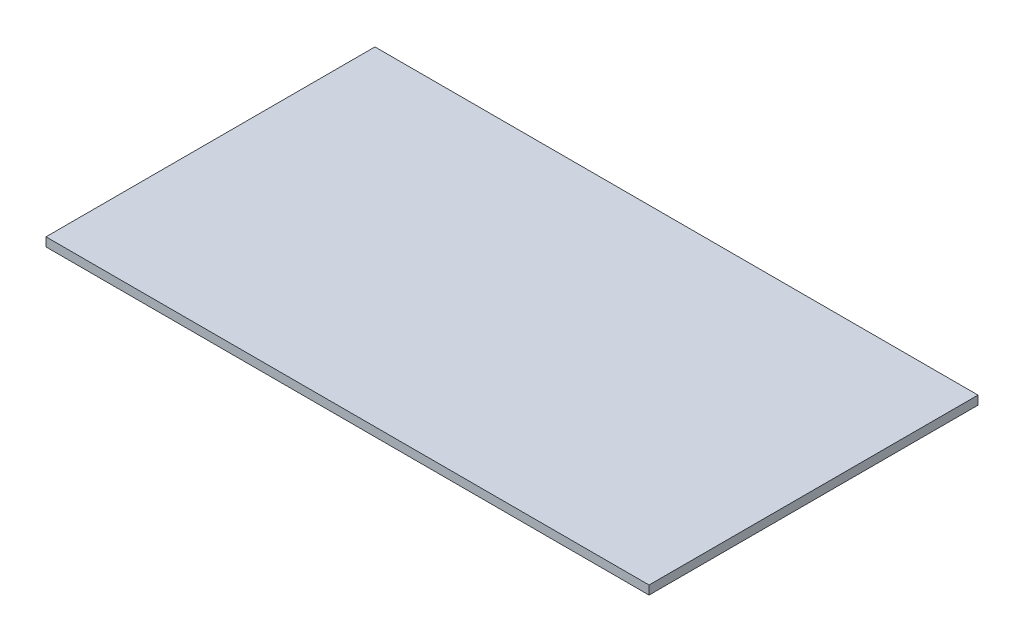
ISO-10303-21;
HEADER;
FILE_DESCRIPTION(('STEP AP214'),'2;1');
FILE_NAME('part.step','',(''),(''),'','','');
FILE_SCHEMA(('AUTOMOTIVE_DESIGN { 1 0 10303 214 1 1 1 1 }'));
ENDSEC;
DATA;
#1=APPLICATION_CONTEXT('core data for automotive mechanical design processes');
#2=APPLICATION_PROTOCOL_DEFINITION('international standard','automotive_design',2000,#1);
#3=PRODUCT_CONTEXT('',#1,'mechanical');
#4=PRODUCT('Part','Part','',(#3));
#5=PRODUCT_RELATED_PRODUCT_CATEGORY('part','',(#4));
#6=PRODUCT_DEFINITION_FORMATION('','',#4);
#7=PRODUCT_DEFINITION_CONTEXT('part definition',#1,'design');
#8=PRODUCT_DEFINITION('design','',#6,#7);
#9=PRODUCT_DEFINITION_SHAPE('','',#8);
#10=(LENGTH_UNIT() NAMED_UNIT(*) SI_UNIT(.MILLI.,.METRE.));
#11=(NAMED_UNIT(*) PLANE_ANGLE_UNIT() SI_UNIT($,.RADIAN.));
#12=(NAMED_UNIT(*) SI_UNIT($,.STERADIAN.) SOLID_ANGLE_UNIT());
#13=UNCERTAINTY_MEASURE_WITH_UNIT(LENGTH_MEASURE(1.E-05),#10,'distance_accuracy_value','');
#14=(GEOMETRIC_REPRESENTATION_CONTEXT(3) GLOBAL_UNCERTAINTY_ASSIGNED_CONTEXT((#13)) GLOBAL_UNIT_ASSIGNED_CONTEXT((#10,
#11,#12)) REPRESENTATION_CONTEXT('',''));
#15=CARTESIAN_POINT('',(0.,0.,0.));
#16=DIRECTION('',(0.,0.,1.));
#17=DIRECTION('',(1.,0.,0.));
#18=AXIS2_PLACEMENT_3D('',#15,#16,#17);
#19=CARTESIAN_POINT('',(275.,8.,150.));
#20=DIRECTION('',(-1.,0.,0.));
#21=DIRECTION('',(0.,0.,1.));
#22=AXIS2_PLACEMENT_3D('',#19,#20,#21);
#23=PLANE('',#22);
#24=DIRECTION('',(0.,0.,-1.));
#25=VECTOR('',#24,1.);
#26=CARTESIAN_POINT('',(275.,0.,150.));
#27=LINE('',#26,#25);
#28=CARTESIAN_POINT('',(275.,0.,150.));
#29=VERTEX_POINT('',#28);
#30=CARTESIAN_POINT('',(275.,0.,-150.));
#31=VERTEX_POINT('',#30);
#32=EDGE_CURVE('E96',#29,#31,#27,.T.);
#33=ORIENTED_EDGE('',*,*,#32,.T.);
#34=DIRECTION('',(0.,-1.,0.));
#35=VECTOR('',#34,1.);
#36=CARTESIAN_POINT('',(275.,8.,-150.));
#37=LINE('',#36,#35);
#38=CARTESIAN_POINT('',(275.,8.,-150.));
#39=VERTEX_POINT('',#38);
#40=EDGE_CURVE('E11',#39,#31,#37,.T.);
#41=ORIENTED_EDGE('',*,*,#40,.F.);
#42=DIRECTION('',(0.,0.,-1.));
#43=VECTOR('',#42,1.);
#44=CARTESIAN_POINT('',(275.,8.,150.));
#45=LINE('',#44,#43);
#46=CARTESIAN_POINT('',(275.,8.,150.));
#47=VERTEX_POINT('',#46);
#48=EDGE_CURVE('E84',#47,#39,#45,.T.);
#49=ORIENTED_EDGE('',*,*,#48,.F.);
#50=DIRECTION('',(0.,-1.,0.));
#51=VECTOR('',#50,1.);
#52=CARTESIAN_POINT('',(275.,8.,150.));
#53=LINE('',#52,#51);
#54=EDGE_CURVE('E92',#47,#29,#53,.T.);
#55=ORIENTED_EDGE('',*,*,#54,.T.);
#56=EDGE_LOOP('',(#33,#41,#49,#55));
#57=FACE_BOUND('',#56,.T.);
#58=ADVANCED_FACE('F33',(#57),#23,.F.);
#59=CARTESIAN_POINT('',(-275.,8.,-150.));
#60=DIRECTION('',(0.,0.,1.));
#61=DIRECTION('',(1.,0.,0.));
#62=AXIS2_PLACEMENT_3D('',#59,#60,#61);
#63=PLANE('',#62);
#64=DIRECTION('',(-1.,0.,0.));
#65=VECTOR('',#64,1.);
#66=CARTESIAN_POINT('',(-275.,0.,-150.));
#67=LINE('',#66,#65);
#68=CARTESIAN_POINT('',(-275.,0.,-150.));
#69=VERTEX_POINT('',#68);
#70=EDGE_CURVE('E88',#31,#69,#67,.T.);
#71=ORIENTED_EDGE('',*,*,#70,.T.);
#72=DIRECTION('',(0.,-1.,0.));
#73=VECTOR('',#72,1.);
#74=CARTESIAN_POINT('',(-275.,8.,-150.));
#75=LINE('',#74,#73);
#76=CARTESIAN_POINT('',(-275.,8.,-150.));
#77=VERTEX_POINT('',#76);
#78=EDGE_CURVE('E41',#77,#69,#75,.T.);
#79=ORIENTED_EDGE('',*,*,#78,.F.);
#80=DIRECTION('',(-1.,0.,0.));
#81=VECTOR('',#80,1.);
#82=CARTESIAN_POINT('',(-275.,8.,-150.));
#83=LINE('',#82,#81);
#84=EDGE_CURVE('E79',#39,#77,#83,.T.);
#85=ORIENTED_EDGE('',*,*,#84,.F.);
#86=ORIENTED_EDGE('',*,*,#40,.T.);
#87=EDGE_LOOP('',(#71,#79,#85,#86));
#88=FACE_BOUND('',#87,.T.);
#89=ADVANCED_FACE('F87',(#88),#63,.F.);
#90=CARTESIAN_POINT('',(-275.,8.,150.));
#91=DIRECTION('',(1.,0.,0.));
#92=DIRECTION('',(0.,0.,-1.));
#93=AXIS2_PLACEMENT_3D('',#90,#91,#92);
#94=PLANE('',#93);
#95=DIRECTION('',(0.,0.,1.));
#96=VECTOR('',#95,1.);
#97=CARTESIAN_POINT('',(-275.,0.,150.));
#98=LINE('',#97,#96);
#99=CARTESIAN_POINT('',(-275.,0.,150.));
#100=VERTEX_POINT('',#99);
#101=EDGE_CURVE('E66',#69,#100,#98,.T.);
#102=ORIENTED_EDGE('',*,*,#101,.T.);
#103=DIRECTION('',(0.,-1.,0.));
#104=VECTOR('',#103,1.);
#105=CARTESIAN_POINT('',(-275.,8.,150.));
#106=LINE('',#105,#104);
#107=CARTESIAN_POINT('',(-275.,8.,150.));
#108=VERTEX_POINT('',#107);
#109=EDGE_CURVE('E89',#108,#100,#106,.T.);
#110=ORIENTED_EDGE('',*,*,#109,.F.);
#111=DIRECTION('',(0.,0.,1.));
#112=VECTOR('',#111,1.);
#113=CARTESIAN_POINT('',(-275.,8.,150.));
#114=LINE('',#113,#112);
#115=EDGE_CURVE('E82',#77,#108,#114,.T.);
#116=ORIENTED_EDGE('',*,*,#115,.F.);
#117=ORIENTED_EDGE('',*,*,#78,.T.);
#118=EDGE_LOOP('',(#102,#110,#116,#117));
#119=FACE_BOUND('',#118,.T.);
#120=ADVANCED_FACE('F90',(#119),#94,.F.);
#121=CARTESIAN_POINT('',(-275.,8.,150.));
#122=DIRECTION('',(0.,0.,-1.));
#123=DIRECTION('',(-1.,0.,0.));
#124=AXIS2_PLACEMENT_3D('',#121,#122,#123);
#125=PLANE('',#124);
#126=DIRECTION('',(1.,0.,0.));
#127=VECTOR('',#126,1.);
#128=CARTESIAN_POINT('',(-275.,0.,150.));
#129=LINE('',#128,#127);
#130=EDGE_CURVE('E72',#100,#29,#129,.T.);
#131=ORIENTED_EDGE('',*,*,#130,.T.);
#132=ORIENTED_EDGE('',*,*,#54,.F.);
#133=DIRECTION('',(1.,0.,0.));
#134=VECTOR('',#133,1.);
#135=CARTESIAN_POINT('',(-275.,8.,150.));
#136=LINE('',#135,#134);
#137=EDGE_CURVE('E49',#108,#47,#136,.T.);
#138=ORIENTED_EDGE('',*,*,#137,.F.);
#139=ORIENTED_EDGE('',*,*,#109,.T.);
#140=EDGE_LOOP('',(#131,#132,#138,#139));
#141=FACE_BOUND('',#140,.T.);
#142=ADVANCED_FACE('F103',(#141),#125,.F.);
#143=CARTESIAN_POINT('',(0.,8.,0.));
#144=DIRECTION('',(0.,-1.,0.));
#145=DIRECTION('',(0.,0.,-1.));
#146=AXIS2_PLACEMENT_3D('',#143,#144,#145);
#147=PLANE('',#146);
#148=ORIENTED_EDGE('',*,*,#48,.T.);
#149=ORIENTED_EDGE('',*,*,#84,.T.);
#150=ORIENTED_EDGE('',*,*,#115,.T.);
#151=ORIENTED_EDGE('',*,*,#137,.T.);
#152=EDGE_LOOP('',(#148,#149,#150,#151));
#153=FACE_BOUND('',#152,.T.);
#154=ADVANCED_FACE('F80',(#153),#147,.F.);
#155=CARTESIAN_POINT('',(0.,0.,0.));
#156=DIRECTION('',(0.,-1.,0.));
#157=DIRECTION('',(0.,0.,-1.));
#158=AXIS2_PLACEMENT_3D('',#155,#156,#157);
#159=PLANE('',#158);
#160=ORIENTED_EDGE('',*,*,#32,.F.);
#161=ORIENTED_EDGE('',*,*,#130,.F.);
#162=ORIENTED_EDGE('',*,*,#101,.F.);
#163=ORIENTED_EDGE('',*,*,#70,.F.);
#164=EDGE_LOOP('',(#160,#161,#162,#163));
#165=FACE_BOUND('',#164,.T.);
#166=ADVANCED_FACE('F106',(#165),#159,.T.);
#167=CLOSED_SHELL('',(#58,#89,#120,#142,#154,#166));
#168=MANIFOLD_SOLID_BREP('B2',#167);
#169=ADVANCED_BREP_SHAPE_REPRESENTATION('',(#18,#168),#14);
#170=SHAPE_DEFINITION_REPRESENTATION(#9,#169);
ENDSEC;
END-ISO-10303-21;
